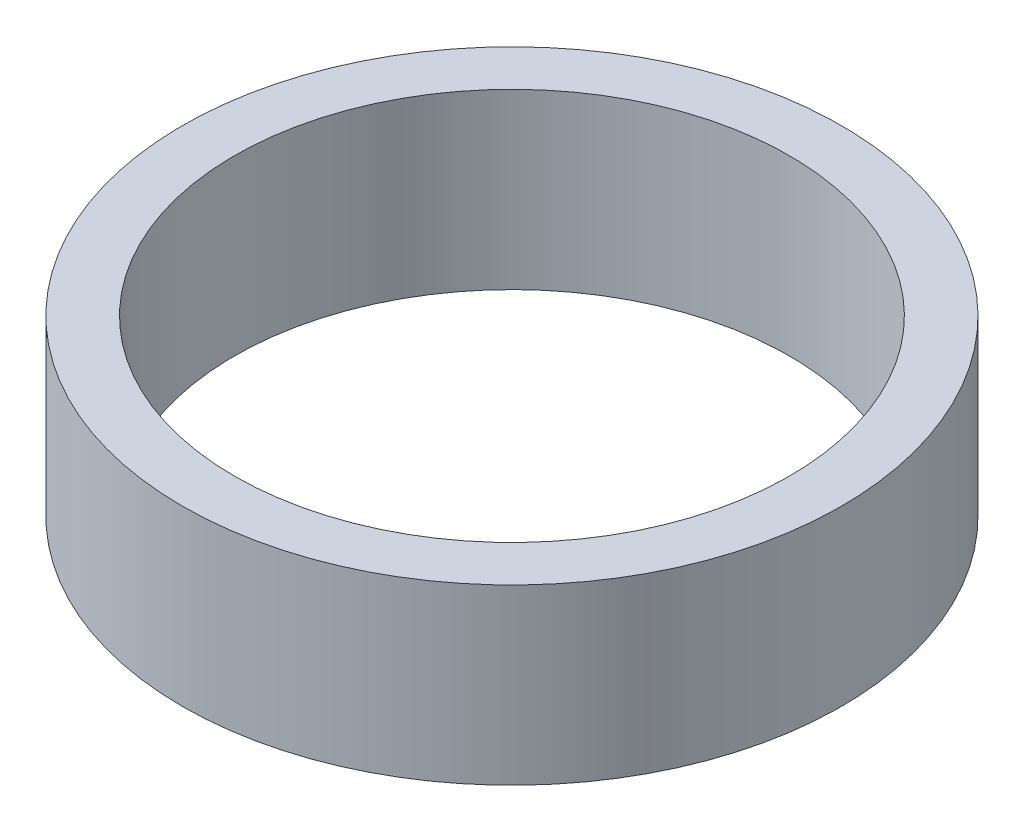
ISO-10303-21;
HEADER;
FILE_DESCRIPTION(('STEP AP214'),'2;1');
FILE_NAME('part.step','',(''),(''),'','','');
FILE_SCHEMA(('AUTOMOTIVE_DESIGN { 1 0 10303 214 1 1 1 1 }'));
ENDSEC;
DATA;
#1=APPLICATION_CONTEXT('core data for automotive mechanical design processes');
#2=APPLICATION_PROTOCOL_DEFINITION('international standard','automotive_design',2000,#1);
#3=PRODUCT_CONTEXT('',#1,'mechanical');
#4=PRODUCT('Part','Part','',(#3));
#5=PRODUCT_RELATED_PRODUCT_CATEGORY('part','',(#4));
#6=PRODUCT_DEFINITION_FORMATION('','',#4);
#7=PRODUCT_DEFINITION_CONTEXT('part definition',#1,'design');
#8=PRODUCT_DEFINITION('design','',#6,#7);
#9=PRODUCT_DEFINITION_SHAPE('','',#8);
#10=(LENGTH_UNIT() NAMED_UNIT(*) SI_UNIT(.MILLI.,.METRE.));
#11=(NAMED_UNIT(*) PLANE_ANGLE_UNIT() SI_UNIT($,.RADIAN.));
#12=(NAMED_UNIT(*) SI_UNIT($,.STERADIAN.) SOLID_ANGLE_UNIT());
#13=UNCERTAINTY_MEASURE_WITH_UNIT(LENGTH_MEASURE(1.E-05),#10,'distance_accuracy_value','');
#14=(GEOMETRIC_REPRESENTATION_CONTEXT(3) GLOBAL_UNCERTAINTY_ASSIGNED_CONTEXT((#13)) GLOBAL_UNIT_ASSIGNED_CONTEXT((#10,
#11,#12)) REPRESENTATION_CONTEXT('',''));
#15=CARTESIAN_POINT('',(0.,0.,0.));
#16=DIRECTION('',(0.,0.,1.));
#17=DIRECTION('',(1.,0.,0.));
#18=AXIS2_PLACEMENT_3D('',#15,#16,#17);
#19=CARTESIAN_POINT('',(0.,25.,0.));
#20=DIRECTION('',(0.,-1.,0.));
#21=DIRECTION('',(0.,0.,-1.));
#22=AXIS2_PLACEMENT_3D('',#19,#20,#21);
#23=CYLINDRICAL_SURFACE('',#22,47.5);
#24=CARTESIAN_POINT('',(0.,25.,0.));
#25=DIRECTION('',(0.,1.,0.));
#26=DIRECTION('',(0.,0.,1.));
#27=AXIS2_PLACEMENT_3D('',#24,#25,#26);
#28=CIRCLE('',#27,47.5);
#29=CARTESIAN_POINT('',(0.,25.,47.5));
#30=VERTEX_POINT('',#29);
#31=EDGE_CURVE('E10',#30,#30,#28,.T.);
#32=ORIENTED_EDGE('',*,*,#31,.F.);
#33=EDGE_LOOP('',(#32));
#34=FACE_BOUND('',#33,.T.);
#35=CARTESIAN_POINT('',(0.,0.,0.));
#36=DIRECTION('',(0.,1.,0.));
#37=DIRECTION('',(0.,0.,1.));
#38=AXIS2_PLACEMENT_3D('',#35,#36,#37);
#39=CIRCLE('',#38,47.5);
#40=CARTESIAN_POINT('',(0.,0.,47.5));
#41=VERTEX_POINT('',#40);
#42=EDGE_CURVE('E37',#41,#41,#39,.T.);
#43=ORIENTED_EDGE('',*,*,#42,.T.);
#44=EDGE_LOOP('',(#43));
#45=FACE_BOUND('',#44,.T.);
#46=ADVANCED_FACE('F40',(#34,#45),#23,.T.);
#47=CARTESIAN_POINT('',(0.,25.,0.));
#48=DIRECTION('',(0.,1.,0.));
#49=DIRECTION('',(0.,0.,1.));
#50=AXIS2_PLACEMENT_3D('',#47,#48,#49);
#51=PLANE('',#50);
#52=CARTESIAN_POINT('',(0.,25.,0.));
#53=DIRECTION('',(0.,1.,0.));
#54=DIRECTION('',(0.,0.,1.));
#55=AXIS2_PLACEMENT_3D('',#52,#53,#54);
#56=CIRCLE('',#55,40.);
#57=CARTESIAN_POINT('',(0.,25.,40.));
#58=VERTEX_POINT('',#57);
#59=EDGE_CURVE('E50',#58,#58,#56,.T.);
#60=ORIENTED_EDGE('',*,*,#59,.F.);
#61=EDGE_LOOP('',(#60));
#62=FACE_BOUND('',#61,.T.);
#63=ORIENTED_EDGE('',*,*,#31,.T.);
#64=EDGE_LOOP('',(#63));
#65=FACE_BOUND('',#64,.T.);
#66=ADVANCED_FACE('F59',(#62,#65),#51,.T.);
#67=CARTESIAN_POINT('',(0.,0.,0.));
#68=DIRECTION('',(0.,1.,0.));
#69=DIRECTION('',(0.,0.,1.));
#70=AXIS2_PLACEMENT_3D('',#67,#68,#69);
#71=PLANE('',#70);
#72=CARTESIAN_POINT('',(0.,0.,0.));
#73=DIRECTION('',(0.,1.,0.));
#74=DIRECTION('',(0.,0.,1.));
#75=AXIS2_PLACEMENT_3D('',#72,#73,#74);
#76=CIRCLE('',#75,40.);
#77=CARTESIAN_POINT('',(0.,0.,40.));
#78=VERTEX_POINT('',#77);
#79=EDGE_CURVE('E47',#78,#78,#76,.T.);
#80=ORIENTED_EDGE('',*,*,#79,.T.);
#81=EDGE_LOOP('',(#80));
#82=FACE_BOUND('',#81,.T.);
#83=ORIENTED_EDGE('',*,*,#42,.F.);
#84=EDGE_LOOP('',(#83));
#85=FACE_BOUND('',#84,.T.);
#86=ADVANCED_FACE('F58',(#82,#85),#71,.F.);
#87=CARTESIAN_POINT('',(0.,25.,0.));
#88=DIRECTION('',(0.,-1.,0.));
#89=DIRECTION('',(0.,0.,-1.));
#90=AXIS2_PLACEMENT_3D('',#87,#88,#89);
#91=CYLINDRICAL_SURFACE('',#90,40.);
#92=ORIENTED_EDGE('',*,*,#59,.T.);
#93=EDGE_LOOP('',(#92));
#94=FACE_BOUND('',#93,.T.);
#95=ORIENTED_EDGE('',*,*,#79,.F.);
#96=EDGE_LOOP('',(#95));
#97=FACE_BOUND('',#96,.T.);
#98=ADVANCED_FACE('F54',(#94,#97),#91,.F.);
#99=CLOSED_SHELL('',(#46,#66,#86,#98));
#100=MANIFOLD_SOLID_BREP('B2',#99);
#101=ADVANCED_BREP_SHAPE_REPRESENTATION('',(#18,#100),#14);
#102=SHAPE_DEFINITION_REPRESENTATION(#9,#101);
ENDSEC;
END-ISO-10303-21;
